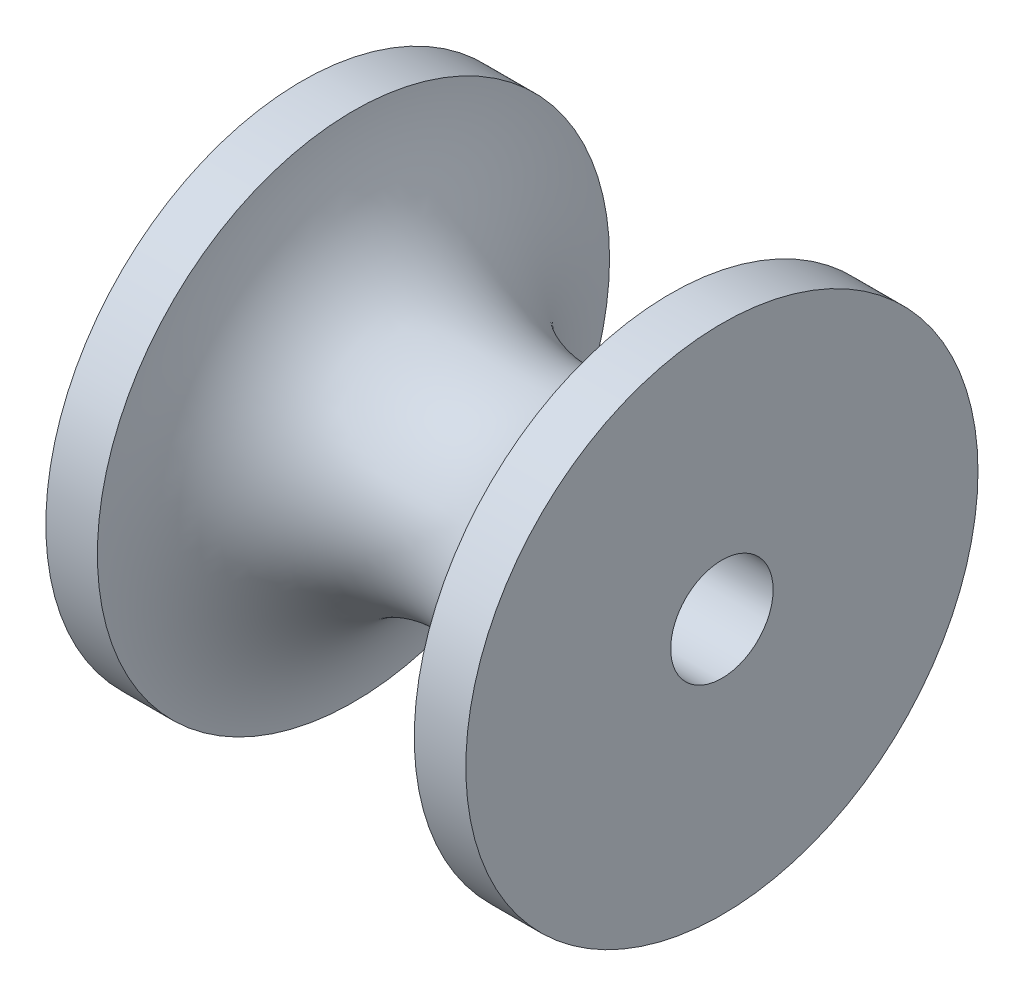
ISO-10303-21;
HEADER;
FILE_DESCRIPTION(('STEP AP214'),'2;1');
FILE_NAME('part.step','',(''),(''),'','','');
FILE_SCHEMA(('AUTOMOTIVE_DESIGN { 1 0 10303 214 1 1 1 1 }'));
ENDSEC;
DATA;
#1=APPLICATION_CONTEXT('core data for automotive mechanical design processes');
#2=APPLICATION_PROTOCOL_DEFINITION('international standard','automotive_design',2000,#1);
#3=PRODUCT_CONTEXT('',#1,'mechanical');
#4=PRODUCT('Part','Part','',(#3));
#5=PRODUCT_RELATED_PRODUCT_CATEGORY('part','',(#4));
#6=PRODUCT_DEFINITION_FORMATION('','',#4);
#7=PRODUCT_DEFINITION_CONTEXT('part definition',#1,'design');
#8=PRODUCT_DEFINITION('design','',#6,#7);
#9=PRODUCT_DEFINITION_SHAPE('','',#8);
#10=(LENGTH_UNIT() NAMED_UNIT(*) SI_UNIT(.MILLI.,.METRE.));
#11=(NAMED_UNIT(*) PLANE_ANGLE_UNIT() SI_UNIT($,.RADIAN.));
#12=(NAMED_UNIT(*) SI_UNIT($,.STERADIAN.) SOLID_ANGLE_UNIT());
#13=UNCERTAINTY_MEASURE_WITH_UNIT(LENGTH_MEASURE(1.E-05),#10,'distance_accuracy_value','');
#14=(GEOMETRIC_REPRESENTATION_CONTEXT(3) GLOBAL_UNCERTAINTY_ASSIGNED_CONTEXT((#13)) GLOBAL_UNIT_ASSIGNED_CONTEXT((#10,
#11,#12)) REPRESENTATION_CONTEXT('',''));
#15=CARTESIAN_POINT('',(0.,0.,0.));
#16=DIRECTION('',(0.,0.,1.));
#17=DIRECTION('',(1.,0.,0.));
#18=AXIS2_PLACEMENT_3D('',#15,#16,#17);
#19=CARTESIAN_POINT('',(11.8572618872006,0.,0.));
#20=DIRECTION('',(1.,0.,0.));
#21=DIRECTION('',(0.,0.,-1.));
#22=AXIS2_PLACEMENT_3D('',#19,#20,#21);
#23=CYLINDRICAL_SURFACE('',#22,5.);
#24=CARTESIAN_POINT('',(-4.1,0.,0.));
#25=DIRECTION('',(1.,0.,0.));
#26=DIRECTION('',(0.,0.,-1.));
#27=AXIS2_PLACEMENT_3D('',#24,#25,#26);
#28=CIRCLE('',#27,5.);
#29=CARTESIAN_POINT('',(-4.1,0.,-5.));
#30=VERTEX_POINT('',#29);
#31=EDGE_CURVE('E10',#30,#30,#28,.T.);
#32=ORIENTED_EDGE('',*,*,#31,.T.);
#33=EDGE_LOOP('',(#32));
#34=FACE_BOUND('',#33,.T.);
#35=CARTESIAN_POINT('',(-3.0935416596516,0.,0.));
#36=DIRECTION('',(1.,0.,0.));
#37=DIRECTION('',(0.,0.,-1.));
#38=AXIS2_PLACEMENT_3D('',#35,#36,#37);
#39=CIRCLE('',#38,5.);
#40=CARTESIAN_POINT('',(-3.0935416596516,0.,-5.));
#41=VERTEX_POINT('',#40);
#42=EDGE_CURVE('E56',#41,#41,#39,.T.);
#43=ORIENTED_EDGE('',*,*,#42,.F.);
#44=EDGE_LOOP('',(#43));
#45=FACE_BOUND('',#44,.T.);
#46=ADVANCED_FACE('F34',(#34,#45),#23,.T.);
#47=CARTESIAN_POINT('',(-4.1,0.999999999999999,0.));
#48=DIRECTION('',(-1.,0.,0.));
#49=DIRECTION('',(0.,0.,1.));
#50=AXIS2_PLACEMENT_3D('',#47,#48,#49);
#51=PLANE('',#50);
#52=CARTESIAN_POINT('',(-4.1,0.,0.));
#53=DIRECTION('',(1.,0.,0.));
#54=DIRECTION('',(0.,0.,-1.));
#55=AXIS2_PLACEMENT_3D('',#52,#53,#54);
#56=CIRCLE('',#55,0.999999999999999);
#57=CARTESIAN_POINT('',(-4.1,0.,-0.999999999999999));
#58=VERTEX_POINT('',#57);
#59=EDGE_CURVE('E40',#58,#58,#56,.T.);
#60=ORIENTED_EDGE('',*,*,#59,.T.);
#61=EDGE_LOOP('',(#60));
#62=FACE_BOUND('',#61,.T.);
#63=ORIENTED_EDGE('',*,*,#31,.F.);
#64=EDGE_LOOP('',(#63));
#65=FACE_BOUND('',#64,.T.);
#66=ADVANCED_FACE('F64',(#62,#65),#51,.T.);
#67=CARTESIAN_POINT('',(11.8572618872006,0.,0.));
#68=DIRECTION('',(1.,0.,0.));
#69=DIRECTION('',(0.,0.,-1.));
#70=AXIS2_PLACEMENT_3D('',#67,#68,#69);
#71=CYLINDRICAL_SURFACE('',#70,1.);
#72=CARTESIAN_POINT('',(4.1,0.,0.));
#73=DIRECTION('',(1.,0.,0.));
#74=DIRECTION('',(0.,0.,-1.));
#75=AXIS2_PLACEMENT_3D('',#72,#73,#74);
#76=CIRCLE('',#75,1.);
#77=CARTESIAN_POINT('',(4.1,0.,-1.));
#78=VERTEX_POINT('',#77);
#79=EDGE_CURVE('E44',#78,#78,#76,.T.);
#80=ORIENTED_EDGE('',*,*,#79,.T.);
#81=EDGE_LOOP('',(#80));
#82=FACE_BOUND('',#81,.T.);
#83=ORIENTED_EDGE('',*,*,#59,.F.);
#84=EDGE_LOOP('',(#83));
#85=FACE_BOUND('',#84,.T.);
#86=ADVANCED_FACE('F68',(#82,#85),#71,.F.);
#87=CARTESIAN_POINT('',(4.1,1.,0.));
#88=DIRECTION('',(1.,0.,0.));
#89=DIRECTION('',(0.,0.,-1.));
#90=AXIS2_PLACEMENT_3D('',#87,#88,#89);
#91=PLANE('',#90);
#92=CARTESIAN_POINT('',(4.1,0.,0.));
#93=DIRECTION('',(1.,0.,0.));
#94=DIRECTION('',(0.,0.,-1.));
#95=AXIS2_PLACEMENT_3D('',#92,#93,#94);
#96=CIRCLE('',#95,5.);
#97=CARTESIAN_POINT('',(4.1,0.,-5.));
#98=VERTEX_POINT('',#97);
#99=EDGE_CURVE('E48',#98,#98,#96,.T.);
#100=ORIENTED_EDGE('',*,*,#99,.T.);
#101=EDGE_LOOP('',(#100));
#102=FACE_BOUND('',#101,.T.);
#103=ORIENTED_EDGE('',*,*,#79,.F.);
#104=EDGE_LOOP('',(#103));
#105=FACE_BOUND('',#104,.T.);
#106=ADVANCED_FACE('F72',(#102,#105),#91,.T.);
#107=CARTESIAN_POINT('',(11.8572618872006,0.,0.));
#108=DIRECTION('',(1.,0.,0.));
#109=DIRECTION('',(0.,0.,-1.));
#110=AXIS2_PLACEMENT_3D('',#107,#108,#109);
#111=CYLINDRICAL_SURFACE('',#110,5.);
#112=CARTESIAN_POINT('',(3.0935416596516,0.,0.));
#113=DIRECTION('',(1.,0.,0.));
#114=DIRECTION('',(0.,0.,-1.));
#115=AXIS2_PLACEMENT_3D('',#112,#113,#114);
#116=CIRCLE('',#115,5.);
#117=CARTESIAN_POINT('',(3.0935416596516,0.,-5.));
#118=VERTEX_POINT('',#117);
#119=EDGE_CURVE('E53',#118,#118,#116,.T.);
#120=ORIENTED_EDGE('',*,*,#119,.T.);
#121=EDGE_LOOP('',(#120));
#122=FACE_BOUND('',#121,.T.);
#123=ORIENTED_EDGE('',*,*,#99,.F.);
#124=EDGE_LOOP('',(#123));
#125=FACE_BOUND('',#124,.T.);
#126=ADVANCED_FACE('F79',(#122,#125),#111,.T.);
#127=CARTESIAN_POINT('',(0.,0.,0.));
#128=DIRECTION('',(1.,0.,0.));
#129=DIRECTION('',(0.,0.,-1.));
#130=AXIS2_PLACEMENT_3D('',#127,#128,#129);
#131=TOROIDAL_SURFACE('',#130,5.2,3.1);
#132=ORIENTED_EDGE('',*,*,#42,.T.);
#133=EDGE_LOOP('',(#132));
#134=FACE_BOUND('',#133,.T.);
#135=ORIENTED_EDGE('',*,*,#119,.F.);
#136=EDGE_LOOP('',(#135));
#137=FACE_BOUND('',#136,.T.);
#138=ADVANCED_FACE('F60',(#134,#137),#131,.F.);
#139=CLOSED_SHELL('',(#46,#66,#86,#106,#126,#138));
#140=MANIFOLD_SOLID_BREP('B2',#139);
#141=ADVANCED_BREP_SHAPE_REPRESENTATION('',(#18,#140),#14);
#142=SHAPE_DEFINITION_REPRESENTATION(#9,#141);
ENDSEC;
END-ISO-10303-21;
